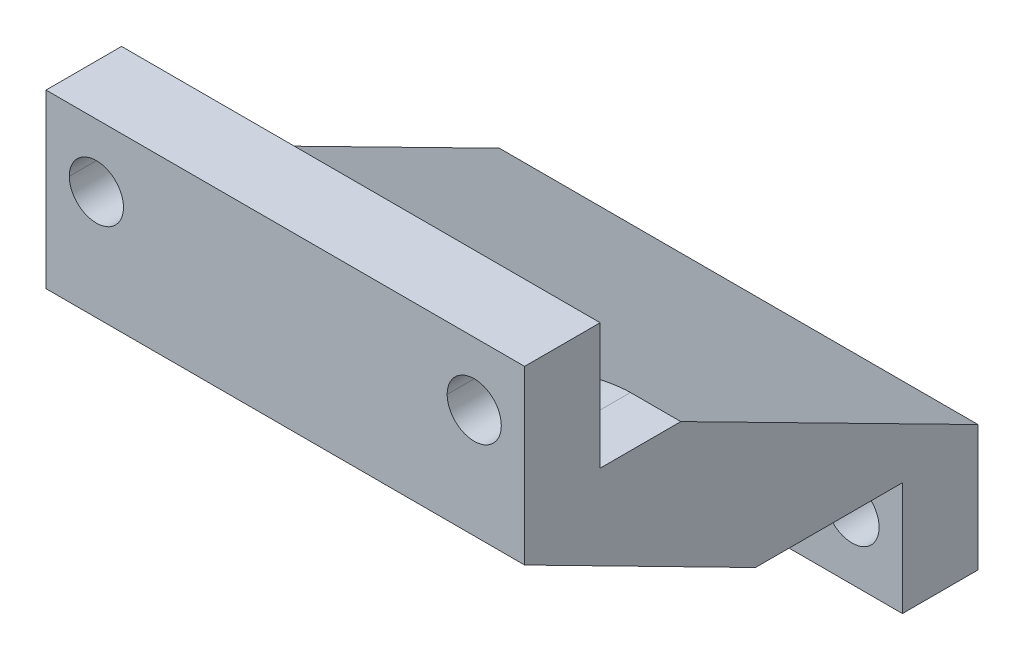
ISO-10303-21;
HEADER;
FILE_DESCRIPTION(('STEP AP214'),'2;1');
FILE_NAME('part.step','',(''),(''),'','','');
FILE_SCHEMA(('AUTOMOTIVE_DESIGN { 1 0 10303 214 1 1 1 1 }'));
ENDSEC;
DATA;
#1=APPLICATION_CONTEXT('core data for automotive mechanical design processes');
#2=APPLICATION_PROTOCOL_DEFINITION('international standard','automotive_design',2000,#1);
#3=PRODUCT_CONTEXT('',#1,'mechanical');
#4=PRODUCT('Part','Part','',(#3));
#5=PRODUCT_RELATED_PRODUCT_CATEGORY('part','',(#4));
#6=PRODUCT_DEFINITION_FORMATION('','',#4);
#7=PRODUCT_DEFINITION_CONTEXT('part definition',#1,'design');
#8=PRODUCT_DEFINITION('design','',#6,#7);
#9=PRODUCT_DEFINITION_SHAPE('','',#8);
#10=(LENGTH_UNIT() NAMED_UNIT(*) SI_UNIT(.MILLI.,.METRE.));
#11=(NAMED_UNIT(*) PLANE_ANGLE_UNIT() SI_UNIT($,.RADIAN.));
#12=(NAMED_UNIT(*) SI_UNIT($,.STERADIAN.) SOLID_ANGLE_UNIT());
#13=UNCERTAINTY_MEASURE_WITH_UNIT(LENGTH_MEASURE(1.E-05),#10,'distance_accuracy_value','');
#14=(GEOMETRIC_REPRESENTATION_CONTEXT(3) GLOBAL_UNCERTAINTY_ASSIGNED_CONTEXT((#13)) GLOBAL_UNIT_ASSIGNED_CONTEXT((#10,
#11,#12)) REPRESENTATION_CONTEXT('',''));
#15=CARTESIAN_POINT('',(0.,0.,0.));
#16=DIRECTION('',(0.,0.,1.));
#17=DIRECTION('',(1.,0.,0.));
#18=AXIS2_PLACEMENT_3D('',#15,#16,#17);
#19=CARTESIAN_POINT('',(80.988658439,-83.376736378,-48.2));
#20=DIRECTION('',(0.,0.891354901098317,-0.45330612205));
#21=DIRECTION('',(-1.,0.,0.));
#22=AXIS2_PLACEMENT_3D('',#19,#20,#21);
#23=PLANE('',#22);
#24=DIRECTION('',(0.,0.45330612205,0.891354901098317));
#25=VECTOR('',#24,1.);
#26=CARTESIAN_POINT('',(80.988658439,-91.005114056,-63.2));
#27=LINE('',#26,#25);
#28=CARTESIAN_POINT('',(80.988658439,-91.005114056,-63.2));
#29=VERTEX_POINT('',#28);
#30=CARTESIAN_POINT('',(80.988658439,-79.005114056,-39.603895088));
#31=VERTEX_POINT('',#30);
#32=EDGE_CURVE('E10',#29,#31,#27,.T.);
#33=ORIENTED_EDGE('',*,*,#32,.T.);
#34=DIRECTION('',(1.,0.,0.));
#35=VECTOR('',#34,1.);
#36=CARTESIAN_POINT('',(80.988658439,-79.005114056,-39.603895088));
#37=LINE('',#36,#35);
#38=CARTESIAN_POINT('',(84.988658439,-79.005114056,-39.603895088));
#39=VERTEX_POINT('',#38);
#40=EDGE_CURVE('E489',#31,#39,#37,.T.);
#41=ORIENTED_EDGE('',*,*,#40,.T.);
#42=CARTESIAN_POINT('',(84.988658439,-79.005114056,-39.603895088));
#43=CARTESIAN_POINT('',(87.1484060837577,-79.0051140561489,-39.6038950883258));
#44=CARTESIAN_POINT('',(88.9219317059475,-77.7725895101201,-37.1803302137587));
#45=CARTESIAN_POINT('',(89.674925408,-75.7483587,-33.2));
#46=(BOUNDED_CURVE() B_SPLINE_CURVE(3,(#42,#43,#44,#45),.UNSPECIFIED.,.F.,
.F.) B_SPLINE_CURVE_WITH_KNOTS((4,4),(0.,1.21466713217462),
.UNSPECIFIED.) CURVE() GEOMETRIC_REPRESENTATION_ITEM() RATIONAL_B_SPLINE_CURVE((1.,
0.880781743643251,0.880781743643251,1.)) REPRESENTATION_ITEM(''));
#47=CARTESIAN_POINT('',(89.674925408,-75.7483587,-33.2));
#48=VERTEX_POINT('',#47);
#49=EDGE_CURVE('E532',#39,#48,#46,.T.);
#50=ORIENTED_EDGE('',*,*,#49,.T.);
#51=DIRECTION('',(1.,0.,0.));
#52=VECTOR('',#51,1.);
#53=CARTESIAN_POINT('',(89.674925408,-75.7483587,-33.2));
#54=LINE('',#53,#52);
#55=CARTESIAN_POINT('',(110.302391469,-75.7483587,-33.2));
#56=VERTEX_POINT('',#55);
#57=EDGE_CURVE('E273',#48,#56,#54,.T.);
#58=ORIENTED_EDGE('',*,*,#57,.T.);
#59=CARTESIAN_POINT('',(110.302391469,-75.7483587,-33.2));
#60=CARTESIAN_POINT('',(111.055385172004,-77.7725895100877,-37.180330213695));
#61=CARTESIAN_POINT('',(112.82891079421,-79.0051140561487,-39.6038950883258));
#62=CARTESIAN_POINT('',(114.988658439,-79.005114056,-39.603895088));
#63=(BOUNDED_CURVE() B_SPLINE_CURVE(3,(#59,#60,#61,#62),.UNSPECIFIED.,.F.,
.F.) B_SPLINE_CURVE_WITH_KNOTS((4,4),(5.06851817498911,6.28318530717959),
.UNSPECIFIED.) CURVE() GEOMETRIC_REPRESENTATION_ITEM() RATIONAL_B_SPLINE_CURVE((1.,
0.880781743640235,0.880781743640235,1.)) REPRESENTATION_ITEM(''));
#64=CARTESIAN_POINT('',(114.988658439,-79.005114056,-39.603895088));
#65=VERTEX_POINT('',#64);
#66=EDGE_CURVE('E505',#56,#65,#63,.T.);
#67=ORIENTED_EDGE('',*,*,#66,.T.);
#68=DIRECTION('',(1.,0.,0.));
#69=VECTOR('',#68,1.);
#70=CARTESIAN_POINT('',(114.988658439,-79.005114056,-39.603895088));
#71=LINE('',#70,#69);
#72=CARTESIAN_POINT('',(118.988658439,-79.005114056,-39.603895088));
#73=VERTEX_POINT('',#72);
#74=EDGE_CURVE('E506',#65,#73,#71,.T.);
#75=ORIENTED_EDGE('',*,*,#74,.T.);
#76=DIRECTION('',(0.,0.45330612205,0.891354901098317));
#77=VECTOR('',#76,1.);
#78=CARTESIAN_POINT('',(118.988658439,-91.005114056,-63.2));
#79=LINE('',#78,#77);
#80=CARTESIAN_POINT('',(118.988658439,-91.005114056,-63.2));
#81=VERTEX_POINT('',#80);
#82=EDGE_CURVE('E285',#81,#73,#79,.T.);
#83=ORIENTED_EDGE('',*,*,#82,.F.);
#84=DIRECTION('',(1.,0.,0.));
#85=VECTOR('',#84,1.);
#86=CARTESIAN_POINT('',(80.988658439,-91.005114056,-63.2));
#87=LINE('',#86,#85);
#88=EDGE_CURVE('E196',#29,#81,#87,.T.);
#89=ORIENTED_EDGE('',*,*,#88,.F.);
#90=EDGE_LOOP('',(#33,#41,#50,#58,#67,#75,#83,#89));
#91=FACE_BOUND('',#90,.T.);
#92=ADVANCED_FACE('F15',(#91),#23,.T.);
#93=CARTESIAN_POINT('',(80.988658439,190.994885944,247.8));
#94=DIRECTION('',(-1.,0.,0.));
#95=DIRECTION('',(0.,0.,1.));
#96=AXIS2_PLACEMENT_3D('',#93,#94,#95);
#97=PLANE('',#96);
#98=DIRECTION('',(0.,-1.,0.));
#99=VECTOR('',#98,1.);
#100=CARTESIAN_POINT('',(80.988658439,-69.005114056,-33.2));
#101=LINE('',#100,#99);
#102=CARTESIAN_POINT('',(80.988658439,-69.005114056,-33.2));
#103=VERTEX_POINT('',#102);
#104=CARTESIAN_POINT('',(80.988658439,-79.005114056,-33.2));
#105=VERTEX_POINT('',#104);
#106=EDGE_CURVE('E269',#103,#105,#101,.T.);
#107=ORIENTED_EDGE('',*,*,#106,.T.);
#108=DIRECTION('',(0.,0.,-1.));
#109=VECTOR('',#108,1.);
#110=CARTESIAN_POINT('',(80.988658439,-79.005114056,-33.2));
#111=LINE('',#110,#109);
#112=EDGE_CURVE('E490',#105,#31,#111,.T.);
#113=ORIENTED_EDGE('',*,*,#112,.T.);
#114=ORIENTED_EDGE('',*,*,#32,.F.);
#115=DIRECTION('',(0.,1.,0.));
#116=VECTOR('',#115,1.);
#117=CARTESIAN_POINT('',(80.988658439,-101.005114056,-63.2));
#118=LINE('',#117,#116);
#119=CARTESIAN_POINT('',(80.988658439,-101.005114056,-63.2));
#120=VERTEX_POINT('',#119);
#121=EDGE_CURVE('E184',#120,#29,#118,.T.);
#122=ORIENTED_EDGE('',*,*,#121,.F.);
#123=DIRECTION('',(0.,0.,1.));
#124=VECTOR('',#123,1.);
#125=CARTESIAN_POINT('',(80.988658439,-101.005114056,-63.2));
#126=LINE('',#125,#124);
#127=CARTESIAN_POINT('',(80.988658439,-101.005114056,-57.2));
#128=VERTEX_POINT('',#127);
#129=EDGE_CURVE('E189',#120,#128,#126,.T.);
#130=ORIENTED_EDGE('',*,*,#129,.T.);
#131=DIRECTION('',(0.,1.,0.));
#132=VECTOR('',#131,1.);
#133=CARTESIAN_POINT('',(80.988658439,-101.005114056,-57.2));
#134=LINE('',#133,#132);
#135=CARTESIAN_POINT('',(80.988658439,-92.005114056,-57.2));
#136=VERTEX_POINT('',#135);
#137=EDGE_CURVE('E249',#128,#136,#134,.T.);
#138=ORIENTED_EDGE('',*,*,#137,.T.);
#139=DIRECTION('',(0.,0.,-1.));
#140=VECTOR('',#139,1.);
#141=CARTESIAN_POINT('',(80.988658439,-92.005114056,-45.533696838));
#142=LINE('',#141,#140);
#143=CARTESIAN_POINT('',(80.988658439,-92.005114056,-45.533696838));
#144=VERTEX_POINT('',#143);
#145=EDGE_CURVE('E305',#144,#136,#142,.T.);
#146=ORIENTED_EDGE('',*,*,#145,.F.);
#147=DIRECTION('',(0.,-0.453933197028941,-0.891035719056809));
#148=VECTOR('',#147,1.);
#149=CARTESIAN_POINT('',(80.988658439,-82.665114056,-27.2));
#150=LINE('',#149,#148);
#151=CARTESIAN_POINT('',(80.988658439,-82.665114056,-27.2));
#152=VERTEX_POINT('',#151);
#153=EDGE_CURVE('E23',#152,#144,#150,.T.);
#154=ORIENTED_EDGE('',*,*,#153,.F.);
#155=DIRECTION('',(0.,-1.,0.));
#156=VECTOR('',#155,1.);
#157=CARTESIAN_POINT('',(80.988658439,-69.005114056,-27.2));
#158=LINE('',#157,#156);
#159=CARTESIAN_POINT('',(80.988658439,-69.005114056,-27.2));
#160=VERTEX_POINT('',#159);
#161=EDGE_CURVE('E248',#160,#152,#158,.T.);
#162=ORIENTED_EDGE('',*,*,#161,.F.);
#163=DIRECTION('',(0.,0.,-1.));
#164=VECTOR('',#163,1.);
#165=CARTESIAN_POINT('',(80.988658439,-69.005114056,-27.2));
#166=LINE('',#165,#164);
#167=EDGE_CURVE('E50',#160,#103,#166,.T.);
#168=ORIENTED_EDGE('',*,*,#167,.T.);
#169=EDGE_LOOP('',(#107,#113,#114,#122,#130,#138,#146,#154,#162,#168));
#170=FACE_BOUND('',#169,.T.);
#171=ADVANCED_FACE('F186',(#170),#97,.T.);
#172=CARTESIAN_POINT('',(80.988658439,-91.835114056,-45.2));
#173=DIRECTION('',(0.,-0.891035719056809,0.453933197028941));
#174=DIRECTION('',(-1.,0.,0.));
#175=AXIS2_PLACEMENT_3D('',#172,#173,#174);
#176=PLANE('',#175);
#177=CARTESIAN_POINT('',(84.988658439,-92.005114056,-45.533696838));
#178=CARTESIAN_POINT('',(87.3318041895076,-92.0051140551195,-45.5336968384951));
#179=CARTESIAN_POINT('',(88.988658439,-93.6619683049765,-48.785973445618));
#180=CARTESIAN_POINT('',(88.988658439,-96.005114056,-53.385387132));
#181=(BOUNDED_CURVE() B_SPLINE_CURVE(3,(#177,#178,#179,#180),.UNSPECIFIED.,.F.,
.F.) B_SPLINE_CURVE_WITH_KNOTS((4,4),(3.1415926535898,4.71238898038469),
.UNSPECIFIED.) CURVE() GEOMETRIC_REPRESENTATION_ITEM() RATIONAL_B_SPLINE_CURVE((1.,
0.804737854124365,0.804737854124365,1.)) REPRESENTATION_ITEM(''));
#182=CARTESIAN_POINT('',(84.988658439,-92.005114056,-45.533696838));
#183=VERTEX_POINT('',#182);
#184=CARTESIAN_POINT('',(88.988658439,-96.005114056,-53.385387132));
#185=VERTEX_POINT('',#184);
#186=EDGE_CURVE('E331',#183,#185,#181,.T.);
#187=ORIENTED_EDGE('',*,*,#186,.T.);
#188=DIRECTION('',(0.,-0.453933197028941,-0.891035719056809));
#189=VECTOR('',#188,1.);
#190=CARTESIAN_POINT('',(88.988658439,-96.005114056,-53.385387132));
#191=LINE('',#190,#189);
#192=CARTESIAN_POINT('',(88.988658439,-97.94844739,-57.2));
#193=VERTEX_POINT('',#192);
#194=EDGE_CURVE('E224',#185,#193,#191,.T.);
#195=ORIENTED_EDGE('',*,*,#194,.T.);
#196=DIRECTION('',(1.,0.,0.));
#197=VECTOR('',#196,1.);
#198=CARTESIAN_POINT('',(88.988658439,-97.94844739,-57.2));
#199=LINE('',#198,#197);
#200=CARTESIAN_POINT('',(110.988658439,-97.94844739,-57.2));
#201=VERTEX_POINT('',#200);
#202=EDGE_CURVE('E247',#193,#201,#199,.T.);
#203=ORIENTED_EDGE('',*,*,#202,.T.);
#204=DIRECTION('',(0.,0.453933197028941,0.891035719056809));
#205=VECTOR('',#204,1.);
#206=CARTESIAN_POINT('',(110.988658439,-97.94844739,-57.2));
#207=LINE('',#206,#205);
#208=CARTESIAN_POINT('',(110.988658439,-96.005114056,-53.385387132));
#209=VERTEX_POINT('',#208);
#210=EDGE_CURVE('E571',#201,#209,#207,.T.);
#211=ORIENTED_EDGE('',*,*,#210,.T.);
#212=CARTESIAN_POINT('',(110.988658439,-96.005114056,-53.385387132));
#213=CARTESIAN_POINT('',(110.988658439,-93.6619683049765,-48.785973445618));
#214=CARTESIAN_POINT('',(112.645512688492,-92.0051140551195,-45.5336968384951));
#215=CARTESIAN_POINT('',(114.988658439,-92.005114056,-45.533696838));
#216=(BOUNDED_CURVE() B_SPLINE_CURVE(3,(#212,#213,#214,#215),.UNSPECIFIED.,.F.,
.F.) B_SPLINE_CURVE_WITH_KNOTS((4,4),(1.5707963267949,3.1415926535898),
.UNSPECIFIED.) CURVE() GEOMETRIC_REPRESENTATION_ITEM() RATIONAL_B_SPLINE_CURVE((1.,
0.804737854124365,0.804737854124365,1.)) REPRESENTATION_ITEM(''));
#217=CARTESIAN_POINT('',(114.988658439,-92.005114056,-45.533696838));
#218=VERTEX_POINT('',#217);
#219=EDGE_CURVE('E584',#209,#218,#216,.T.);
#220=ORIENTED_EDGE('',*,*,#219,.T.);
#221=DIRECTION('',(1.,0.,0.));
#222=VECTOR('',#221,1.);
#223=CARTESIAN_POINT('',(114.988658439,-92.005114056,-45.533696838));
#224=LINE('',#223,#222);
#225=CARTESIAN_POINT('',(118.988658439,-92.005114056,-45.533696838));
#226=VERTEX_POINT('',#225);
#227=EDGE_CURVE('E314',#218,#226,#224,.T.);
#228=ORIENTED_EDGE('',*,*,#227,.T.);
#229=DIRECTION('',(0.,-0.453933197028941,-0.891035719056809));
#230=VECTOR('',#229,1.);
#231=CARTESIAN_POINT('',(118.988658439,-82.665114056,-27.2));
#232=LINE('',#231,#230);
#233=CARTESIAN_POINT('',(118.988658439,-82.665114056,-27.2));
#234=VERTEX_POINT('',#233);
#235=EDGE_CURVE('E284',#234,#226,#232,.T.);
#236=ORIENTED_EDGE('',*,*,#235,.F.);
#237=DIRECTION('',(1.,0.,0.));
#238=VECTOR('',#237,1.);
#239=CARTESIAN_POINT('',(80.988658439,-82.665114056,-27.2));
#240=LINE('',#239,#238);
#241=EDGE_CURVE('E243',#152,#234,#240,.T.);
#242=ORIENTED_EDGE('',*,*,#241,.F.);
#243=ORIENTED_EDGE('',*,*,#153,.T.);
#244=DIRECTION('',(1.,0.,0.));
#245=VECTOR('',#244,1.);
#246=CARTESIAN_POINT('',(80.988658439,-92.005114056,-45.533696838));
#247=LINE('',#246,#245);
#248=EDGE_CURVE('E297',#144,#183,#247,.T.);
#249=ORIENTED_EDGE('',*,*,#248,.T.);
#250=EDGE_LOOP('',(#187,#195,#203,#211,#220,#228,#236,#242,#243,#249));
#251=FACE_BOUND('',#250,.T.);
#252=ADVANCED_FACE('F296',(#251),#176,.T.);
#253=CARTESIAN_POINT('',(118.988658439,190.994885944,247.8));
#254=DIRECTION('',(-1.,0.,0.));
#255=DIRECTION('',(0.,0.,1.));
#256=AXIS2_PLACEMENT_3D('',#253,#254,#255);
#257=PLANE('',#256);
#258=DIRECTION('',(0.,0.,-1.));
#259=VECTOR('',#258,1.);
#260=CARTESIAN_POINT('',(118.988658439,-79.005114056,-33.2));
#261=LINE('',#260,#259);
#262=CARTESIAN_POINT('',(118.988658439,-79.005114056,-33.2));
#263=VERTEX_POINT('',#262);
#264=EDGE_CURVE('E472',#263,#73,#261,.T.);
#265=ORIENTED_EDGE('',*,*,#264,.F.);
#266=DIRECTION('',(0.,-1.,0.));
#267=VECTOR('',#266,1.);
#268=CARTESIAN_POINT('',(118.988658439,-69.005114056,-33.2));
#269=LINE('',#268,#267);
#270=CARTESIAN_POINT('',(118.988658439,-69.005114056,-33.2));
#271=VERTEX_POINT('',#270);
#272=EDGE_CURVE('E277',#271,#263,#269,.T.);
#273=ORIENTED_EDGE('',*,*,#272,.F.);
#274=DIRECTION('',(0.,0.,-1.));
#275=VECTOR('',#274,1.);
#276=CARTESIAN_POINT('',(118.988658439,-69.005114056,-27.2));
#277=LINE('',#276,#275);
#278=CARTESIAN_POINT('',(118.988658439,-69.005114056,-27.2));
#279=VERTEX_POINT('',#278);
#280=EDGE_CURVE('E36',#279,#271,#277,.T.);
#281=ORIENTED_EDGE('',*,*,#280,.F.);
#282=DIRECTION('',(0.,-1.,0.));
#283=VECTOR('',#282,1.);
#284=CARTESIAN_POINT('',(118.988658439,-69.005114056,-27.2));
#285=LINE('',#284,#283);
#286=EDGE_CURVE('E242',#279,#234,#285,.T.);
#287=ORIENTED_EDGE('',*,*,#286,.T.);
#288=ORIENTED_EDGE('',*,*,#235,.T.);
#289=DIRECTION('',(0.,0.,-1.));
#290=VECTOR('',#289,1.);
#291=CARTESIAN_POINT('',(118.988658439,-92.005114056,-45.533696838));
#292=LINE('',#291,#290);
#293=CARTESIAN_POINT('',(118.988658439,-92.005114056,-57.2));
#294=VERTEX_POINT('',#293);
#295=EDGE_CURVE('E322',#226,#294,#292,.T.);
#296=ORIENTED_EDGE('',*,*,#295,.T.);
#297=DIRECTION('',(0.,1.,0.));
#298=VECTOR('',#297,1.);
#299=CARTESIAN_POINT('',(118.988658439,-101.005114056,-57.2));
#300=LINE('',#299,#298);
#301=CARTESIAN_POINT('',(118.988658439,-101.005114056,-57.2));
#302=VERTEX_POINT('',#301);
#303=EDGE_CURVE('E261',#302,#294,#300,.T.);
#304=ORIENTED_EDGE('',*,*,#303,.F.);
#305=DIRECTION('',(0.,0.,1.));
#306=VECTOR('',#305,1.);
#307=CARTESIAN_POINT('',(118.988658439,-101.005114056,-63.2));
#308=LINE('',#307,#306);
#309=CARTESIAN_POINT('',(118.988658439,-101.005114056,-63.2));
#310=VERTEX_POINT('',#309);
#311=EDGE_CURVE('E212',#310,#302,#308,.T.);
#312=ORIENTED_EDGE('',*,*,#311,.F.);
#313=DIRECTION('',(0.,1.,0.));
#314=VECTOR('',#313,1.);
#315=CARTESIAN_POINT('',(118.988658439,-101.005114056,-63.2));
#316=LINE('',#315,#314);
#317=EDGE_CURVE('E197',#310,#81,#316,.T.);
#318=ORIENTED_EDGE('',*,*,#317,.T.);
#319=ORIENTED_EDGE('',*,*,#82,.T.);
#320=EDGE_LOOP('',(#265,#273,#281,#287,#288,#296,#304,#312,#318,#319));
#321=FACE_BOUND('',#320,.T.);
#322=ADVANCED_FACE('F617',(#321),#257,.F.);
#323=CARTESIAN_POINT('',(114.988658439,-96.005114056,-34.2));
#324=DIRECTION('',(0.,0.,-1.));
#325=DIRECTION('',(1.,0.,0.));
#326=AXIS2_PLACEMENT_3D('',#323,#324,#325);
#327=CYLINDRICAL_SURFACE('',#326,2.15);
#328=DIRECTION('',(0.,0.,-1.));
#329=VECTOR('',#328,1.);
#330=CARTESIAN_POINT('',(112.838658439,-96.005114056,-34.2));
#331=LINE('',#330,#329);
#332=CARTESIAN_POINT('',(112.838658439,-96.005114056,-57.2));
#333=VERTEX_POINT('',#332);
#334=CARTESIAN_POINT('',(112.838658439,-96.005114056,-63.2));
#335=VERTEX_POINT('',#334);
#336=EDGE_CURVE('E431',#333,#335,#331,.T.);
#337=ORIENTED_EDGE('',*,*,#336,.F.);
#338=CARTESIAN_POINT('',(114.988658439,-96.005114056,-57.2));
#339=DIRECTION('',(0.,0.,1.));
#340=DIRECTION('',(1.,0.,0.));
#341=AXIS2_PLACEMENT_3D('',#338,#339,#340);
#342=CIRCLE('',#341,2.15);
#343=CARTESIAN_POINT('',(117.138658439,-96.005114056,-57.2));
#344=VERTEX_POINT('',#343);
#345=EDGE_CURVE('E218',#333,#344,#342,.T.);
#346=ORIENTED_EDGE('',*,*,#345,.T.);
#347=DIRECTION('',(0.,0.,-1.));
#348=VECTOR('',#347,1.);
#349=CARTESIAN_POINT('',(117.138658439,-96.005114056,-34.2));
#350=LINE('',#349,#348);
#351=CARTESIAN_POINT('',(117.138658439,-96.005114056,-63.2));
#352=VERTEX_POINT('',#351);
#353=EDGE_CURVE('E428',#344,#352,#350,.T.);
#354=ORIENTED_EDGE('',*,*,#353,.T.);
#355=CARTESIAN_POINT('',(114.988658439,-96.005114056,-63.2));
#356=DIRECTION('',(0.,0.,1.));
#357=DIRECTION('',(-1.,0.,0.));
#358=AXIS2_PLACEMENT_3D('',#355,#356,#357);
#359=CIRCLE('',#358,2.15);
#360=EDGE_CURVE('E252',#335,#352,#359,.T.);
#361=ORIENTED_EDGE('',*,*,#360,.F.);
#362=EDGE_LOOP('',(#337,#346,#354,#361));
#363=FACE_BOUND('',#362,.T.);
#364=ADVANCED_FACE('F427',(#363),#327,.F.);
#365=CARTESIAN_POINT('',(84.988658439,-96.005114056,-34.2));
#366=DIRECTION('',(0.,0.,-1.));
#367=DIRECTION('',(1.,0.,0.));
#368=AXIS2_PLACEMENT_3D('',#365,#366,#367);
#369=CYLINDRICAL_SURFACE('',#368,2.15);
#370=DIRECTION('',(0.,0.,-1.));
#371=VECTOR('',#370,1.);
#372=CARTESIAN_POINT('',(82.838658439,-96.005114056,-34.2));
#373=LINE('',#372,#371);
#374=CARTESIAN_POINT('',(82.838658439,-96.005114056,-57.2));
#375=VERTEX_POINT('',#374);
#376=CARTESIAN_POINT('',(82.838658439,-96.005114056,-63.2));
#377=VERTEX_POINT('',#376);
#378=EDGE_CURVE('E463',#375,#377,#373,.T.);
#379=ORIENTED_EDGE('',*,*,#378,.F.);
#380=CARTESIAN_POINT('',(84.988658439,-96.005114056,-57.2));
#381=DIRECTION('',(0.,0.,1.));
#382=DIRECTION('',(1.,0.,0.));
#383=AXIS2_PLACEMENT_3D('',#380,#381,#382);
#384=CIRCLE('',#383,2.15);
#385=CARTESIAN_POINT('',(87.138658439,-96.005114056,-57.2));
#386=VERTEX_POINT('',#385);
#387=EDGE_CURVE('E257',#375,#386,#384,.T.);
#388=ORIENTED_EDGE('',*,*,#387,.T.);
#389=DIRECTION('',(0.,0.,-1.));
#390=VECTOR('',#389,1.);
#391=CARTESIAN_POINT('',(87.138658439,-96.005114056,-34.2));
#392=LINE('',#391,#390);
#393=CARTESIAN_POINT('',(87.138658439,-96.005114056,-63.2));
#394=VERTEX_POINT('',#393);
#395=EDGE_CURVE('E462',#386,#394,#392,.T.);
#396=ORIENTED_EDGE('',*,*,#395,.T.);
#397=CARTESIAN_POINT('',(84.988658439,-96.005114056,-63.2));
#398=DIRECTION('',(0.,0.,1.));
#399=DIRECTION('',(-1.,0.,0.));
#400=AXIS2_PLACEMENT_3D('',#397,#398,#399);
#401=CIRCLE('',#400,2.15);
#402=EDGE_CURVE('E256',#377,#394,#401,.T.);
#403=ORIENTED_EDGE('',*,*,#402,.F.);
#404=EDGE_LOOP('',(#379,#388,#396,#403));
#405=FACE_BOUND('',#404,.T.);
#406=ADVANCED_FACE('F927',(#405),#369,.F.);
#407=CARTESIAN_POINT('',(80.988658439,-69.005114056,-30.2));
#408=DIRECTION('',(0.,-1.,0.));
#409=DIRECTION('',(0.,0.,-1.));
#410=AXIS2_PLACEMENT_3D('',#407,#408,#409);
#411=PLANE('',#410);
#412=ORIENTED_EDGE('',*,*,#280,.T.);
#413=DIRECTION('',(1.,0.,0.));
#414=VECTOR('',#413,1.);
#415=CARTESIAN_POINT('',(80.988658439,-69.005114056,-33.2));
#416=LINE('',#415,#414);
#417=EDGE_CURVE('E272',#103,#271,#416,.T.);
#418=ORIENTED_EDGE('',*,*,#417,.F.);
#419=ORIENTED_EDGE('',*,*,#167,.F.);
#420=DIRECTION('',(1.,0.,0.));
#421=VECTOR('',#420,1.);
#422=CARTESIAN_POINT('',(80.988658439,-69.005114056,-27.2));
#423=LINE('',#422,#421);
#424=EDGE_CURVE('E538',#160,#279,#423,.T.);
#425=ORIENTED_EDGE('',*,*,#424,.T.);
#426=EDGE_LOOP('',(#412,#418,#419,#425));
#427=FACE_BOUND('',#426,.T.);
#428=ADVANCED_FACE('F918',(#427),#411,.F.);
#429=CARTESIAN_POINT('',(80.988658439,-72.376736378,-33.2));
#430=DIRECTION('',(0.,0.,1.));
#431=DIRECTION('',(1.,0.,0.));
#432=AXIS2_PLACEMENT_3D('',#429,#430,#431);
#433=PLANE('',#432);
#434=CARTESIAN_POINT('',(114.988658439,-74.005114056,-33.2));
#435=DIRECTION('',(0.,0.,-1.));
#436=DIRECTION('',(-1.,0.,0.));
#437=AXIS2_PLACEMENT_3D('',#434,#435,#436);
#438=CIRCLE('',#437,2.15);
#439=CARTESIAN_POINT('',(117.138658439,-74.005114056,-33.2));
#440=VERTEX_POINT('',#439);
#441=CARTESIAN_POINT('',(112.838658439,-74.005114056,-33.2));
#442=VERTEX_POINT('',#441);
#443=EDGE_CURVE('E231',#440,#442,#438,.T.);
#444=ORIENTED_EDGE('',*,*,#443,.F.);
#445=CARTESIAN_POINT('',(114.988658439,-74.005114056,-33.2));
#446=DIRECTION('',(0.,0.,-1.));
#447=DIRECTION('',(-1.,0.,0.));
#448=AXIS2_PLACEMENT_3D('',#445,#446,#447);
#449=CIRCLE('',#448,2.15);
#450=EDGE_CURVE('E457',#442,#440,#449,.T.);
#451=ORIENTED_EDGE('',*,*,#450,.F.);
#452=EDGE_LOOP('',(#444,#451));
#453=FACE_BOUND('',#452,.T.);
#454=CARTESIAN_POINT('',(84.988658439,-74.005114056,-33.2));
#455=DIRECTION('',(0.,0.,-1.));
#456=DIRECTION('',(-1.,0.,0.));
#457=AXIS2_PLACEMENT_3D('',#454,#455,#456);
#458=CIRCLE('',#457,2.15);
#459=CARTESIAN_POINT('',(87.138658439,-74.005114056,-33.2));
#460=VERTEX_POINT('',#459);
#461=CARTESIAN_POINT('',(82.838658439,-74.005114056,-33.2));
#462=VERTEX_POINT('',#461);
#463=EDGE_CURVE('E239',#460,#462,#458,.T.);
#464=ORIENTED_EDGE('',*,*,#463,.F.);
#465=CARTESIAN_POINT('',(84.988658439,-74.005114056,-33.2));
#466=DIRECTION('',(0.,0.,-1.));
#467=DIRECTION('',(-1.,0.,0.));
#468=AXIS2_PLACEMENT_3D('',#465,#466,#467);
#469=CIRCLE('',#468,2.15);
#470=EDGE_CURVE('E500',#462,#460,#469,.T.);
#471=ORIENTED_EDGE('',*,*,#470,.F.);
#472=EDGE_LOOP('',(#464,#471));
#473=FACE_BOUND('',#472,.T.);
#474=ORIENTED_EDGE('',*,*,#57,.F.);
#475=CARTESIAN_POINT('',(84.988658439,-74.005114056,-33.2));
#476=DIRECTION('',(0.,0.,1.));
#477=DIRECTION('',(1.,0.,0.));
#478=AXIS2_PLACEMENT_3D('',#475,#476,#477);
#479=CIRCLE('',#478,5.);
#480=CARTESIAN_POINT('',(84.988658439,-79.005114056,-33.2));
#481=VERTEX_POINT('',#480);
#482=EDGE_CURVE('E528',#481,#48,#479,.T.);
#483=ORIENTED_EDGE('',*,*,#482,.F.);
#484=DIRECTION('',(1.,0.,0.));
#485=VECTOR('',#484,1.);
#486=CARTESIAN_POINT('',(80.988658439,-79.005114056,-33.2));
#487=LINE('',#486,#485);
#488=EDGE_CURVE('E486',#105,#481,#487,.T.);
#489=ORIENTED_EDGE('',*,*,#488,.F.);
#490=ORIENTED_EDGE('',*,*,#106,.F.);
#491=ORIENTED_EDGE('',*,*,#417,.T.);
#492=ORIENTED_EDGE('',*,*,#272,.T.);
#493=DIRECTION('',(1.,0.,0.));
#494=VECTOR('',#493,1.);
#495=CARTESIAN_POINT('',(114.988658439,-79.005114056,-33.2));
#496=LINE('',#495,#494);
#497=CARTESIAN_POINT('',(114.988658439,-79.005114056,-33.2));
#498=VERTEX_POINT('',#497);
#499=EDGE_CURVE('E468',#498,#263,#496,.T.);
#500=ORIENTED_EDGE('',*,*,#499,.F.);
#501=CARTESIAN_POINT('',(114.988658439,-74.005114056,-33.2));
#502=DIRECTION('',(0.,0.,1.));
#503=DIRECTION('',(1.,0.,0.));
#504=AXIS2_PLACEMENT_3D('',#501,#502,#503);
#505=CIRCLE('',#504,5.);
#506=EDGE_CURVE('E510',#56,#498,#505,.T.);
#507=ORIENTED_EDGE('',*,*,#506,.F.);
#508=EDGE_LOOP('',(#474,#483,#489,#490,#491,#492,#500,#507));
#509=FACE_BOUND('',#508,.T.);
#510=ADVANCED_FACE('F910',(#453,#473,#509),#433,.F.);
#511=CARTESIAN_POINT('',(80.988658439,-93.505114056,-63.2));
#512=DIRECTION('',(0.,0.,-1.));
#513=DIRECTION('',(0.,-1.,0.));
#514=AXIS2_PLACEMENT_3D('',#511,#512,#513);
#515=PLANE('',#514);
#516=CARTESIAN_POINT('',(84.988658439,-96.005114056,-63.2));
#517=DIRECTION('',(0.,0.,1.));
#518=DIRECTION('',(-1.,0.,0.));
#519=AXIS2_PLACEMENT_3D('',#516,#517,#518);
#520=CIRCLE('',#519,2.15);
#521=EDGE_CURVE('E459',#394,#377,#520,.T.);
#522=ORIENTED_EDGE('',*,*,#521,.T.);
#523=ORIENTED_EDGE('',*,*,#402,.T.);
#524=EDGE_LOOP('',(#522,#523));
#525=FACE_BOUND('',#524,.T.);
#526=CARTESIAN_POINT('',(114.988658439,-96.005114056,-63.2));
#527=DIRECTION('',(0.,0.,1.));
#528=DIRECTION('',(-1.,0.,0.));
#529=AXIS2_PLACEMENT_3D('',#526,#527,#528);
#530=CIRCLE('',#529,2.15);
#531=EDGE_CURVE('E439',#352,#335,#530,.T.);
#532=ORIENTED_EDGE('',*,*,#531,.T.);
#533=ORIENTED_EDGE('',*,*,#360,.T.);
#534=EDGE_LOOP('',(#532,#533));
#535=FACE_BOUND('',#534,.T.);
#536=ORIENTED_EDGE('',*,*,#317,.F.);
#537=DIRECTION('',(1.,0.,0.));
#538=VECTOR('',#537,1.);
#539=CARTESIAN_POINT('',(80.988658439,-101.005114056,-63.2));
#540=LINE('',#539,#538);
#541=EDGE_CURVE('E200',#120,#310,#540,.T.);
#542=ORIENTED_EDGE('',*,*,#541,.F.);
#543=ORIENTED_EDGE('',*,*,#121,.T.);
#544=ORIENTED_EDGE('',*,*,#88,.T.);
#545=EDGE_LOOP('',(#536,#542,#543,#544));
#546=FACE_BOUND('',#545,.T.);
#547=ADVANCED_FACE('F201',(#525,#535,#546),#515,.T.);
#548=CARTESIAN_POINT('',(80.988658439,-101.005114056,-60.2));
#549=DIRECTION('',(0.,1.,0.));
#550=DIRECTION('',(1.,0.,0.));
#551=AXIS2_PLACEMENT_3D('',#548,#549,#550);
#552=PLANE('',#551);
#553=ORIENTED_EDGE('',*,*,#311,.T.);
#554=DIRECTION('',(1.,0.,0.));
#555=VECTOR('',#554,1.);
#556=CARTESIAN_POINT('',(80.988658439,-101.005114056,-57.2));
#557=LINE('',#556,#555);
#558=EDGE_CURVE('E209',#128,#302,#557,.T.);
#559=ORIENTED_EDGE('',*,*,#558,.F.);
#560=ORIENTED_EDGE('',*,*,#129,.F.);
#561=ORIENTED_EDGE('',*,*,#541,.T.);
#562=EDGE_LOOP('',(#553,#559,#560,#561));
#563=FACE_BOUND('',#562,.T.);
#564=ADVANCED_FACE('F207',(#563),#552,.F.);
#565=CARTESIAN_POINT('',(80.988658439,-99.476780723,-57.2));
#566=DIRECTION('',(0.,0.,-1.));
#567=DIRECTION('',(0.,-1.,0.));
#568=AXIS2_PLACEMENT_3D('',#565,#566,#567);
#569=PLANE('',#568);
#570=CARTESIAN_POINT('',(114.988658439,-96.005114056,-57.2));
#571=DIRECTION('',(0.,0.,1.));
#572=DIRECTION('',(1.,0.,0.));
#573=AXIS2_PLACEMENT_3D('',#570,#571,#572);
#574=CIRCLE('',#573,2.15);
#575=EDGE_CURVE('E437',#344,#333,#574,.T.);
#576=ORIENTED_EDGE('',*,*,#575,.F.);
#577=ORIENTED_EDGE('',*,*,#345,.F.);
#578=EDGE_LOOP('',(#576,#577));
#579=FACE_BOUND('',#578,.T.);
#580=CARTESIAN_POINT('',(84.988658439,-96.005114056,-57.2));
#581=DIRECTION('',(0.,0.,1.));
#582=DIRECTION('',(1.,0.,0.));
#583=AXIS2_PLACEMENT_3D('',#580,#581,#582);
#584=CIRCLE('',#583,2.15);
#585=EDGE_CURVE('E441',#386,#375,#584,.T.);
#586=ORIENTED_EDGE('',*,*,#585,.F.);
#587=ORIENTED_EDGE('',*,*,#387,.F.);
#588=EDGE_LOOP('',(#586,#587));
#589=FACE_BOUND('',#588,.T.);
#590=ORIENTED_EDGE('',*,*,#202,.F.);
#591=DIRECTION('',(0.,1.,0.));
#592=VECTOR('',#591,1.);
#593=CARTESIAN_POINT('',(88.988658439,-97.94844739,-57.2));
#594=LINE('',#593,#592);
#595=CARTESIAN_POINT('',(88.988658439,-96.005114056,-57.2));
#596=VERTEX_POINT('',#595);
#597=EDGE_CURVE('E222',#193,#596,#594,.T.);
#598=ORIENTED_EDGE('',*,*,#597,.T.);
#599=CARTESIAN_POINT('',(84.988658439,-96.005114056,-57.2));
#600=DIRECTION('',(0.,0.,1.));
#601=DIRECTION('',(-1.,0.,0.));
#602=AXIS2_PLACEMENT_3D('',#599,#600,#601);
#603=CIRCLE('',#602,4.);
#604=CARTESIAN_POINT('',(84.988658439,-92.005114056,-57.2));
#605=VERTEX_POINT('',#604);
#606=EDGE_CURVE('E309',#596,#605,#603,.T.);
#607=ORIENTED_EDGE('',*,*,#606,.T.);
#608=DIRECTION('',(-1.,0.,0.));
#609=VECTOR('',#608,1.);
#610=CARTESIAN_POINT('',(84.988658439,-92.005114056,-57.2));
#611=LINE('',#610,#609);
#612=EDGE_CURVE('E313',#605,#136,#611,.T.);
#613=ORIENTED_EDGE('',*,*,#612,.T.);
#614=ORIENTED_EDGE('',*,*,#137,.F.);
#615=ORIENTED_EDGE('',*,*,#558,.T.);
#616=ORIENTED_EDGE('',*,*,#303,.T.);
#617=DIRECTION('',(-1.,0.,0.));
#618=VECTOR('',#617,1.);
#619=CARTESIAN_POINT('',(118.988658439,-92.005114056,-57.2));
#620=LINE('',#619,#618);
#621=CARTESIAN_POINT('',(114.988658439,-92.005114056,-57.2));
#622=VERTEX_POINT('',#621);
#623=EDGE_CURVE('E590',#294,#622,#620,.T.);
#624=ORIENTED_EDGE('',*,*,#623,.T.);
#625=CARTESIAN_POINT('',(114.988658439,-96.005114056,-57.2));
#626=DIRECTION('',(0.,0.,1.));
#627=DIRECTION('',(0.,-1.,0.));
#628=AXIS2_PLACEMENT_3D('',#625,#626,#627);
#629=CIRCLE('',#628,4.);
#630=CARTESIAN_POINT('',(110.988658439,-96.005114056,-57.2));
#631=VERTEX_POINT('',#630);
#632=EDGE_CURVE('E575',#622,#631,#629,.T.);
#633=ORIENTED_EDGE('',*,*,#632,.T.);
#634=DIRECTION('',(0.,-1.,0.));
#635=VECTOR('',#634,1.);
#636=CARTESIAN_POINT('',(110.988658439,-96.005114056,-57.2));
#637=LINE('',#636,#635);
#638=EDGE_CURVE('E501',#631,#201,#637,.T.);
#639=ORIENTED_EDGE('',*,*,#638,.T.);
#640=EDGE_LOOP('',(#590,#598,#607,#613,#614,#615,#616,#624,#633,#639));
#641=FACE_BOUND('',#640,.T.);
#642=ADVANCED_FACE('F347',(#579,#589,#641),#569,.F.);
#643=CARTESIAN_POINT('',(80.988658439,-78.335114056,-27.2));
#644=DIRECTION('',(0.,0.,1.));
#645=DIRECTION('',(1.,0.,0.));
#646=AXIS2_PLACEMENT_3D('',#643,#644,#645);
#647=PLANE('',#646);
#648=CARTESIAN_POINT('',(114.988658439,-74.005114056,-27.2));
#649=DIRECTION('',(0.,0.,-1.));
#650=DIRECTION('',(-1.,0.,0.));
#651=AXIS2_PLACEMENT_3D('',#648,#649,#650);
#652=CIRCLE('',#651,2.15);
#653=CARTESIAN_POINT('',(117.138658439,-74.005114056,-27.2));
#654=VERTEX_POINT('',#653);
#655=CARTESIAN_POINT('',(112.838658439,-74.005114056,-27.2));
#656=VERTEX_POINT('',#655);
#657=EDGE_CURVE('E228',#654,#656,#652,.T.);
#658=ORIENTED_EDGE('',*,*,#657,.T.);
#659=CARTESIAN_POINT('',(114.988658439,-74.005114056,-27.2));
#660=DIRECTION('',(0.,0.,-1.));
#661=DIRECTION('',(-1.,0.,0.));
#662=AXIS2_PLACEMENT_3D('',#659,#660,#661);
#663=CIRCLE('',#662,2.15);
#664=EDGE_CURVE('E458',#656,#654,#663,.T.);
#665=ORIENTED_EDGE('',*,*,#664,.T.);
#666=EDGE_LOOP('',(#658,#665));
#667=FACE_BOUND('',#666,.T.);
#668=CARTESIAN_POINT('',(84.988658439,-74.005114056,-27.2));
#669=DIRECTION('',(0.,0.,-1.));
#670=DIRECTION('',(-1.,0.,0.));
#671=AXIS2_PLACEMENT_3D('',#668,#669,#670);
#672=CIRCLE('',#671,2.15);
#673=CARTESIAN_POINT('',(87.138658439,-74.005114056,-27.2));
#674=VERTEX_POINT('',#673);
#675=CARTESIAN_POINT('',(82.838658439,-74.005114056,-27.2));
#676=VERTEX_POINT('',#675);
#677=EDGE_CURVE('E234',#674,#676,#672,.T.);
#678=ORIENTED_EDGE('',*,*,#677,.T.);
#679=CARTESIAN_POINT('',(84.988658439,-74.005114056,-27.2));
#680=DIRECTION('',(0.,0.,-1.));
#681=DIRECTION('',(-1.,0.,0.));
#682=AXIS2_PLACEMENT_3D('',#679,#680,#681);
#683=CIRCLE('',#682,2.15);
#684=EDGE_CURVE('E493',#676,#674,#683,.T.);
#685=ORIENTED_EDGE('',*,*,#684,.T.);
#686=EDGE_LOOP('',(#678,#685));
#687=FACE_BOUND('',#686,.T.);
#688=ORIENTED_EDGE('',*,*,#286,.F.);
#689=ORIENTED_EDGE('',*,*,#424,.F.);
#690=ORIENTED_EDGE('',*,*,#161,.T.);
#691=ORIENTED_EDGE('',*,*,#241,.T.);
#692=EDGE_LOOP('',(#688,#689,#690,#691));
#693=FACE_BOUND('',#692,.T.);
#694=ADVANCED_FACE('F879',(#667,#687,#693),#647,.T.);
#695=CARTESIAN_POINT('',(84.988658439,-74.005114056,-13.2));
#696=DIRECTION('',(0.,0.,-1.));
#697=DIRECTION('',(1.,0.,0.));
#698=AXIS2_PLACEMENT_3D('',#695,#696,#697);
#699=CYLINDRICAL_SURFACE('',#698,2.15);
#700=DIRECTION('',(0.,0.,-1.));
#701=VECTOR('',#700,1.);
#702=CARTESIAN_POINT('',(82.838658439,-74.005114056,-13.2));
#703=LINE('',#702,#701);
#704=EDGE_CURVE('E496',#676,#462,#703,.T.);
#705=ORIENTED_EDGE('',*,*,#704,.F.);
#706=ORIENTED_EDGE('',*,*,#677,.F.);
#707=DIRECTION('',(0.,0.,-1.));
#708=VECTOR('',#707,1.);
#709=CARTESIAN_POINT('',(87.138658439,-74.005114056,-13.2));
#710=LINE('',#709,#708);
#711=EDGE_CURVE('E485',#674,#460,#710,.T.);
#712=ORIENTED_EDGE('',*,*,#711,.T.);
#713=ORIENTED_EDGE('',*,*,#463,.T.);
#714=EDGE_LOOP('',(#705,#706,#712,#713));
#715=FACE_BOUND('',#714,.T.);
#716=ADVANCED_FACE('F773',(#715),#699,.F.);
#717=CARTESIAN_POINT('',(114.988658439,-74.005114056,-13.2));
#718=DIRECTION('',(0.,0.,-1.));
#719=DIRECTION('',(1.,0.,0.));
#720=AXIS2_PLACEMENT_3D('',#717,#718,#719);
#721=CYLINDRICAL_SURFACE('',#720,2.15);
#722=DIRECTION('',(0.,0.,-1.));
#723=VECTOR('',#722,1.);
#724=CARTESIAN_POINT('',(112.838658439,-74.005114056,-13.2));
#725=LINE('',#724,#723);
#726=EDGE_CURVE('E453',#656,#442,#725,.T.);
#727=ORIENTED_EDGE('',*,*,#726,.F.);
#728=ORIENTED_EDGE('',*,*,#657,.F.);
#729=DIRECTION('',(0.,0.,-1.));
#730=VECTOR('',#729,1.);
#731=CARTESIAN_POINT('',(117.138658439,-74.005114056,-13.2));
#732=LINE('',#731,#730);
#733=EDGE_CURVE('E511',#654,#440,#732,.T.);
#734=ORIENTED_EDGE('',*,*,#733,.T.);
#735=ORIENTED_EDGE('',*,*,#443,.T.);
#736=EDGE_LOOP('',(#727,#728,#734,#735));
#737=FACE_BOUND('',#736,.T.);
#738=ADVANCED_FACE('F769',(#737),#721,.F.);
#739=CARTESIAN_POINT('',(88.988658439,-96.005114056,-24.2));
#740=DIRECTION('',(-1.,0.,0.));
#741=DIRECTION('',(0.,0.,1.));
#742=AXIS2_PLACEMENT_3D('',#739,#740,#741);
#743=PLANE('',#742);
#744=DIRECTION('',(0.,0.,-1.));
#745=VECTOR('',#744,1.);
#746=CARTESIAN_POINT('',(88.988658439,-96.005114056,-53.385387132));
#747=LINE('',#746,#745);
#748=EDGE_CURVE('E328',#185,#596,#747,.T.);
#749=ORIENTED_EDGE('',*,*,#748,.T.);
#750=ORIENTED_EDGE('',*,*,#597,.F.);
#751=ORIENTED_EDGE('',*,*,#194,.F.);
#752=EDGE_LOOP('',(#749,#750,#751));
#753=FACE_BOUND('',#752,.T.);
#754=ADVANCED_FACE('F351',(#753),#743,.T.);
#755=CARTESIAN_POINT('',(84.988658439,-96.005114056,-24.2));
#756=DIRECTION('',(0.,0.,-1.));
#757=DIRECTION('',(1.,0.,0.));
#758=AXIS2_PLACEMENT_3D('',#755,#756,#757);
#759=CYLINDRICAL_SURFACE('',#758,4.);
#760=DIRECTION('',(0.,0.,-1.));
#761=VECTOR('',#760,1.);
#762=CARTESIAN_POINT('',(84.988658439,-92.005114056,-45.533696838));
#763=LINE('',#762,#761);
#764=EDGE_CURVE('E307',#183,#605,#763,.T.);
#765=ORIENTED_EDGE('',*,*,#764,.T.);
#766=ORIENTED_EDGE('',*,*,#606,.F.);
#767=ORIENTED_EDGE('',*,*,#748,.F.);
#768=ORIENTED_EDGE('',*,*,#186,.F.);
#769=EDGE_LOOP('',(#765,#766,#767,#768));
#770=FACE_BOUND('',#769,.T.);
#771=ADVANCED_FACE('F353',(#770),#759,.F.);
#772=CARTESIAN_POINT('',(84.988658439,-92.005114056,-24.2));
#773=DIRECTION('',(0.,-1.,0.));
#774=DIRECTION('',(0.,0.,-1.));
#775=AXIS2_PLACEMENT_3D('',#772,#773,#774);
#776=PLANE('',#775);
#777=ORIENTED_EDGE('',*,*,#145,.T.);
#778=ORIENTED_EDGE('',*,*,#612,.F.);
#779=ORIENTED_EDGE('',*,*,#764,.F.);
#780=ORIENTED_EDGE('',*,*,#248,.F.);
#781=EDGE_LOOP('',(#777,#778,#779,#780));
#782=FACE_BOUND('',#781,.T.);
#783=ADVANCED_FACE('F303',(#782),#776,.T.);
#784=CARTESIAN_POINT('',(114.988658439,-92.005114056,-24.2));
#785=DIRECTION('',(0.,-1.,0.));
#786=DIRECTION('',(0.,0.,-1.));
#787=AXIS2_PLACEMENT_3D('',#784,#785,#786);
#788=PLANE('',#787);
#789=DIRECTION('',(0.,0.,-1.));
#790=VECTOR('',#789,1.);
#791=CARTESIAN_POINT('',(114.988658439,-92.005114056,-45.533696838));
#792=LINE('',#791,#790);
#793=EDGE_CURVE('E578',#218,#622,#792,.T.);
#794=ORIENTED_EDGE('',*,*,#793,.T.);
#795=ORIENTED_EDGE('',*,*,#623,.F.);
#796=ORIENTED_EDGE('',*,*,#295,.F.);
#797=ORIENTED_EDGE('',*,*,#227,.F.);
#798=EDGE_LOOP('',(#794,#795,#796,#797));
#799=FACE_BOUND('',#798,.T.);
#800=ADVANCED_FACE('F613',(#799),#788,.T.);
#801=CARTESIAN_POINT('',(114.988658439,-96.005114056,-24.2));
#802=DIRECTION('',(0.,0.,-1.));
#803=DIRECTION('',(0.,1.,0.));
#804=AXIS2_PLACEMENT_3D('',#801,#802,#803);
#805=CYLINDRICAL_SURFACE('',#804,4.);
#806=DIRECTION('',(0.,0.,-1.));
#807=VECTOR('',#806,1.);
#808=CARTESIAN_POINT('',(110.988658439,-96.005114056,-53.385387132));
#809=LINE('',#808,#807);
#810=EDGE_CURVE('E504',#209,#631,#809,.T.);
#811=ORIENTED_EDGE('',*,*,#810,.T.);
#812=ORIENTED_EDGE('',*,*,#632,.F.);
#813=ORIENTED_EDGE('',*,*,#793,.F.);
#814=ORIENTED_EDGE('',*,*,#219,.F.);
#815=EDGE_LOOP('',(#811,#812,#813,#814));
#816=FACE_BOUND('',#815,.T.);
#817=ADVANCED_FACE('F610',(#816),#805,.F.);
#818=CARTESIAN_POINT('',(110.988658439,-96.005114056,-24.2));
#819=DIRECTION('',(1.,0.,0.));
#820=DIRECTION('',(0.,1.,0.));
#821=AXIS2_PLACEMENT_3D('',#818,#819,#820);
#822=PLANE('',#821);
#823=ORIENTED_EDGE('',*,*,#638,.F.);
#824=ORIENTED_EDGE('',*,*,#810,.F.);
#825=ORIENTED_EDGE('',*,*,#210,.F.);
#826=EDGE_LOOP('',(#823,#824,#825));
#827=FACE_BOUND('',#826,.T.);
#828=ADVANCED_FACE('F605',(#827),#822,.T.);
#829=CARTESIAN_POINT('',(114.988658439,-74.005114056,-33.2));
#830=DIRECTION('',(0.,0.,-1.));
#831=DIRECTION('',(-1.,0.,0.));
#832=AXIS2_PLACEMENT_3D('',#829,#830,#831);
#833=CYLINDRICAL_SURFACE('',#832,5.);
#834=ORIENTED_EDGE('',*,*,#506,.T.);
#835=DIRECTION('',(0.,0.,-1.));
#836=VECTOR('',#835,1.);
#837=CARTESIAN_POINT('',(114.988658439,-79.005114056,-33.2));
#838=LINE('',#837,#836);
#839=EDGE_CURVE('E473',#498,#65,#838,.T.);
#840=ORIENTED_EDGE('',*,*,#839,.T.);
#841=ORIENTED_EDGE('',*,*,#66,.F.);
#842=EDGE_LOOP('',(#834,#840,#841));
#843=FACE_BOUND('',#842,.T.);
#844=ADVANCED_FACE('F834',(#843),#833,.F.);
#845=CARTESIAN_POINT('',(114.988658439,-79.005114056,-33.2));
#846=DIRECTION('',(0.,1.,0.));
#847=DIRECTION('',(1.,0.,0.));
#848=AXIS2_PLACEMENT_3D('',#845,#846,#847);
#849=PLANE('',#848);
#850=ORIENTED_EDGE('',*,*,#839,.F.);
#851=ORIENTED_EDGE('',*,*,#499,.T.);
#852=ORIENTED_EDGE('',*,*,#264,.T.);
#853=ORIENTED_EDGE('',*,*,#74,.F.);
#854=EDGE_LOOP('',(#850,#851,#852,#853));
#855=FACE_BOUND('',#854,.T.);
#856=ADVANCED_FACE('F825',(#855),#849,.T.);
#857=CARTESIAN_POINT('',(84.988658439,-79.005114056,-33.2));
#858=DIRECTION('',(0.,1.,0.));
#859=DIRECTION('',(1.,0.,0.));
#860=AXIS2_PLACEMENT_3D('',#857,#858,#859);
#861=PLANE('',#860);
#862=ORIENTED_EDGE('',*,*,#112,.F.);
#863=ORIENTED_EDGE('',*,*,#488,.T.);
#864=DIRECTION('',(0.,0.,-1.));
#865=VECTOR('',#864,1.);
#866=CARTESIAN_POINT('',(84.988658439,-79.005114056,-33.2));
#867=LINE('',#866,#865);
#868=EDGE_CURVE('E515',#481,#39,#867,.T.);
#869=ORIENTED_EDGE('',*,*,#868,.T.);
#870=ORIENTED_EDGE('',*,*,#40,.F.);
#871=EDGE_LOOP('',(#862,#863,#869,#870));
#872=FACE_BOUND('',#871,.T.);
#873=ADVANCED_FACE('F800',(#872),#861,.T.);
#874=CARTESIAN_POINT('',(84.988658439,-74.005114056,-33.2));
#875=DIRECTION('',(0.,0.,-1.));
#876=DIRECTION('',(0.,-1.,0.));
#877=AXIS2_PLACEMENT_3D('',#874,#875,#876);
#878=CYLINDRICAL_SURFACE('',#877,5.);
#879=ORIENTED_EDGE('',*,*,#868,.F.);
#880=ORIENTED_EDGE('',*,*,#482,.T.);
#881=ORIENTED_EDGE('',*,*,#49,.F.);
#882=EDGE_LOOP('',(#879,#880,#881));
#883=FACE_BOUND('',#882,.T.);
#884=ADVANCED_FACE('F795',(#883),#878,.F.);
#885=CARTESIAN_POINT('',(114.988658439,-74.005114056,-13.2));
#886=DIRECTION('',(0.,0.,-1.));
#887=DIRECTION('',(1.,0.,0.));
#888=AXIS2_PLACEMENT_3D('',#885,#886,#887);
#889=CYLINDRICAL_SURFACE('',#888,2.15);
#890=ORIENTED_EDGE('',*,*,#664,.F.);
#891=ORIENTED_EDGE('',*,*,#726,.T.);
#892=ORIENTED_EDGE('',*,*,#450,.T.);
#893=ORIENTED_EDGE('',*,*,#733,.F.);
#894=EDGE_LOOP('',(#890,#891,#892,#893));
#895=FACE_BOUND('',#894,.T.);
#896=ADVANCED_FACE('F799',(#895),#889,.F.);
#897=CARTESIAN_POINT('',(84.988658439,-74.005114056,-13.2));
#898=DIRECTION('',(0.,0.,-1.));
#899=DIRECTION('',(1.,0.,0.));
#900=AXIS2_PLACEMENT_3D('',#897,#898,#899);
#901=CYLINDRICAL_SURFACE('',#900,2.15);
#902=ORIENTED_EDGE('',*,*,#684,.F.);
#903=ORIENTED_EDGE('',*,*,#704,.T.);
#904=ORIENTED_EDGE('',*,*,#470,.T.);
#905=ORIENTED_EDGE('',*,*,#711,.F.);
#906=EDGE_LOOP('',(#902,#903,#904,#905));
#907=FACE_BOUND('',#906,.T.);
#908=ADVANCED_FACE('F782',(#907),#901,.F.);
#909=CARTESIAN_POINT('',(84.988658439,-96.005114056,-34.2));
#910=DIRECTION('',(0.,0.,-1.));
#911=DIRECTION('',(1.,0.,0.));
#912=AXIS2_PLACEMENT_3D('',#909,#910,#911);
#913=CYLINDRICAL_SURFACE('',#912,2.15);
#914=ORIENTED_EDGE('',*,*,#585,.T.);
#915=ORIENTED_EDGE('',*,*,#378,.T.);
#916=ORIENTED_EDGE('',*,*,#521,.F.);
#917=ORIENTED_EDGE('',*,*,#395,.F.);
#918=EDGE_LOOP('',(#914,#915,#916,#917));
#919=FACE_BOUND('',#918,.T.);
#920=ADVANCED_FACE('F764',(#919),#913,.F.);
#921=CARTESIAN_POINT('',(114.988658439,-96.005114056,-34.2));
#922=DIRECTION('',(0.,0.,-1.));
#923=DIRECTION('',(1.,0.,0.));
#924=AXIS2_PLACEMENT_3D('',#921,#922,#923);
#925=CYLINDRICAL_SURFACE('',#924,2.15);
#926=ORIENTED_EDGE('',*,*,#575,.T.);
#927=ORIENTED_EDGE('',*,*,#336,.T.);
#928=ORIENTED_EDGE('',*,*,#531,.F.);
#929=ORIENTED_EDGE('',*,*,#353,.F.);
#930=EDGE_LOOP('',(#926,#927,#928,#929));
#931=FACE_BOUND('',#930,.T.);
#932=ADVANCED_FACE('F436',(#931),#925,.F.);
#933=CLOSED_SHELL('',(#92,#171,#252,#322,#364,#406,#428,#510,#547,#564,#642,#694,#716,#738,#754,
#771,#783,#800,#817,#828,#844,#856,#873,#884,#896,#908,#920,#932));
#934=MANIFOLD_SOLID_BREP('B1',#933);
#935=ADVANCED_BREP_SHAPE_REPRESENTATION('',(#18,#934),#14);
#936=SHAPE_DEFINITION_REPRESENTATION(#9,#935);
ENDSEC;
END-ISO-10303-21;
